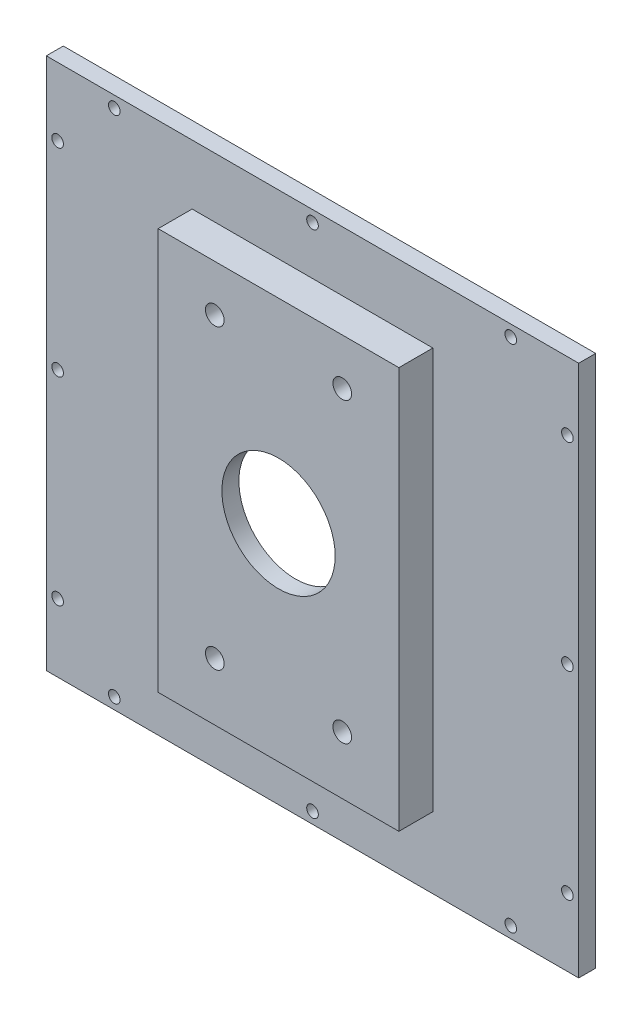
ISO-10303-21;
HEADER;
FILE_DESCRIPTION(('STEP AP214'),'2;1');
FILE_NAME('part.step','',(''),(''),'','','');
FILE_SCHEMA(('AUTOMOTIVE_DESIGN { 1 0 10303 214 1 1 1 1 }'));
ENDSEC;
DATA;
#1=APPLICATION_CONTEXT('core data for automotive mechanical design processes');
#2=APPLICATION_PROTOCOL_DEFINITION('international standard','automotive_design',2000,#1);
#3=PRODUCT_CONTEXT('',#1,'mechanical');
#4=PRODUCT('Part','Part','',(#3));
#5=PRODUCT_RELATED_PRODUCT_CATEGORY('part','',(#4));
#6=PRODUCT_DEFINITION_FORMATION('','',#4);
#7=PRODUCT_DEFINITION_CONTEXT('part definition',#1,'design');
#8=PRODUCT_DEFINITION('design','',#6,#7);
#9=PRODUCT_DEFINITION_SHAPE('','',#8);
#10=(LENGTH_UNIT() NAMED_UNIT(*) SI_UNIT(.MILLI.,.METRE.));
#11=(NAMED_UNIT(*) PLANE_ANGLE_UNIT() SI_UNIT($,.RADIAN.));
#12=(NAMED_UNIT(*) SI_UNIT($,.STERADIAN.) SOLID_ANGLE_UNIT());
#13=UNCERTAINTY_MEASURE_WITH_UNIT(LENGTH_MEASURE(1.E-05),#10,'distance_accuracy_value','');
#14=(GEOMETRIC_REPRESENTATION_CONTEXT(3) GLOBAL_UNCERTAINTY_ASSIGNED_CONTEXT((#13)) GLOBAL_UNIT_ASSIGNED_CONTEXT((#10,
#11,#12)) REPRESENTATION_CONTEXT('',''));
#15=CARTESIAN_POINT('',(0.,0.,0.));
#16=DIRECTION('',(0.,0.,1.));
#17=DIRECTION('',(1.,0.,0.));
#18=AXIS2_PLACEMENT_3D('',#15,#16,#17);
#19=CARTESIAN_POINT('',(-47.0000000000002,-1.66533453693774E-13,3.));
#20=DIRECTION('',(1.,0.,0.));
#21=DIRECTION('',(0.,1.,0.));
#22=AXIS2_PLACEMENT_3D('',#19,#20,#21);
#23=PLANE('',#22);
#24=DIRECTION('',(0.,-1.,0.));
#25=VECTOR('',#24,1.);
#26=CARTESIAN_POINT('',(-47.0000000000002,-1.66533453693774E-13,0.));
#27=LINE('',#26,#25);
#28=CARTESIAN_POINT('',(-47.0000000000003,44.9999999999998,0.));
#29=VERTEX_POINT('',#28);
#30=CARTESIAN_POINT('',(-47.,-49.0000000000002,0.));
#31=VERTEX_POINT('',#30);
#32=EDGE_CURVE('E125',#29,#31,#27,.T.);
#33=ORIENTED_EDGE('',*,*,#32,.T.);
#34=DIRECTION('',(0.,0.,-1.));
#35=VECTOR('',#34,1.);
#36=CARTESIAN_POINT('',(-47.,-49.0000000000002,3.));
#37=LINE('',#36,#35);
#38=CARTESIAN_POINT('',(-47.,-49.0000000000002,3.));
#39=VERTEX_POINT('',#38);
#40=EDGE_CURVE('E11',#39,#31,#37,.T.);
#41=ORIENTED_EDGE('',*,*,#40,.F.);
#42=DIRECTION('',(0.,-1.,0.));
#43=VECTOR('',#42,1.);
#44=CARTESIAN_POINT('',(-47.0000000000002,-1.66533453693774E-13,3.));
#45=LINE('',#44,#43);
#46=CARTESIAN_POINT('',(-47.0000000000003,44.9999999999998,3.));
#47=VERTEX_POINT('',#46);
#48=EDGE_CURVE('E133',#47,#39,#45,.T.);
#49=ORIENTED_EDGE('',*,*,#48,.F.);
#50=DIRECTION('',(0.,0.,-1.));
#51=VECTOR('',#50,1.);
#52=CARTESIAN_POINT('',(-47.0000000000003,44.9999999999998,3.));
#53=LINE('',#52,#51);
#54=EDGE_CURVE('E107',#47,#29,#53,.T.);
#55=ORIENTED_EDGE('',*,*,#54,.T.);
#56=EDGE_LOOP('',(#33,#41,#49,#55));
#57=FACE_BOUND('',#56,.T.);
#58=ADVANCED_FACE('F39',(#57),#23,.F.);
#59=CARTESIAN_POINT('',(-4.76008121807852E-12,-48.9999999999956,3.));
#60=DIRECTION('',(0.,1.,0.));
#61=DIRECTION('',(-1.,0.,0.));
#62=AXIS2_PLACEMENT_3D('',#59,#60,#61);
#63=PLANE('',#62);
#64=DIRECTION('',(1.,0.,0.));
#65=VECTOR('',#64,1.);
#66=CARTESIAN_POINT('',(-4.76008121807852E-12,-48.9999999999956,0.));
#67=LINE('',#66,#65);
#68=CARTESIAN_POINT('',(47.0000000000003,-49.0000000000002,0.));
#69=VERTEX_POINT('',#68);
#70=EDGE_CURVE('E128',#31,#69,#67,.T.);
#71=ORIENTED_EDGE('',*,*,#70,.T.);
#72=DIRECTION('',(0.,0.,-1.));
#73=VECTOR('',#72,1.);
#74=CARTESIAN_POINT('',(47.0000000000003,-49.0000000000002,3.));
#75=LINE('',#74,#73);
#76=CARTESIAN_POINT('',(47.0000000000003,-49.0000000000002,3.));
#77=VERTEX_POINT('',#76);
#78=EDGE_CURVE('E48',#77,#69,#75,.T.);
#79=ORIENTED_EDGE('',*,*,#78,.F.);
#80=DIRECTION('',(1.,0.,0.));
#81=VECTOR('',#80,1.);
#82=CARTESIAN_POINT('',(-4.76008121807852E-12,-48.9999999999956,3.));
#83=LINE('',#82,#81);
#84=EDGE_CURVE('E91',#39,#77,#83,.T.);
#85=ORIENTED_EDGE('',*,*,#84,.F.);
#86=ORIENTED_EDGE('',*,*,#40,.T.);
#87=EDGE_LOOP('',(#71,#79,#85,#86));
#88=FACE_BOUND('',#87,.T.);
#89=ADVANCED_FACE('F297',(#88),#63,.F.);
#90=CARTESIAN_POINT('',(47.0000000000002,1.66533453693774E-13,3.));
#91=DIRECTION('',(-1.,0.,0.));
#92=DIRECTION('',(0.,-1.,0.));
#93=AXIS2_PLACEMENT_3D('',#90,#91,#92);
#94=PLANE('',#93);
#95=DIRECTION('',(0.,1.,0.));
#96=VECTOR('',#95,1.);
#97=CARTESIAN_POINT('',(47.0000000000002,1.66533453693774E-13,0.));
#98=LINE('',#97,#96);
#99=CARTESIAN_POINT('',(47.,44.9999999999998,0.));
#100=VERTEX_POINT('',#99);
#101=EDGE_CURVE('E76',#69,#100,#98,.T.);
#102=ORIENTED_EDGE('',*,*,#101,.T.);
#103=DIRECTION('',(0.,0.,-1.));
#104=VECTOR('',#103,1.);
#105=CARTESIAN_POINT('',(47.,44.9999999999998,3.));
#106=LINE('',#105,#104);
#107=CARTESIAN_POINT('',(47.,44.9999999999998,3.));
#108=VERTEX_POINT('',#107);
#109=EDGE_CURVE('E105',#108,#100,#106,.T.);
#110=ORIENTED_EDGE('',*,*,#109,.F.);
#111=DIRECTION('',(0.,1.,0.));
#112=VECTOR('',#111,1.);
#113=CARTESIAN_POINT('',(47.0000000000002,1.66533453693774E-13,3.));
#114=LINE('',#113,#112);
#115=EDGE_CURVE('E99',#77,#108,#114,.T.);
#116=ORIENTED_EDGE('',*,*,#115,.F.);
#117=ORIENTED_EDGE('',*,*,#78,.T.);
#118=EDGE_LOOP('',(#102,#110,#116,#117));
#119=FACE_BOUND('',#118,.T.);
#120=ADVANCED_FACE('F106',(#119),#94,.F.);
#121=CARTESIAN_POINT('',(3.98119037736674E-12,45.000000000004,3.));
#122=DIRECTION('',(0.,-1.,0.));
#123=DIRECTION('',(1.,0.,0.));
#124=AXIS2_PLACEMENT_3D('',#121,#122,#123);
#125=PLANE('',#124);
#126=DIRECTION('',(-1.,0.,0.));
#127=VECTOR('',#126,1.);
#128=CARTESIAN_POINT('',(3.98119037736674E-12,45.000000000004,0.));
#129=LINE('',#128,#127);
#130=EDGE_CURVE('E83',#100,#29,#129,.T.);
#131=ORIENTED_EDGE('',*,*,#130,.T.);
#132=ORIENTED_EDGE('',*,*,#54,.F.);
#133=DIRECTION('',(-1.,0.,0.));
#134=VECTOR('',#133,1.);
#135=CARTESIAN_POINT('',(3.98119037736674E-12,45.000000000004,3.));
#136=LINE('',#135,#134);
#137=EDGE_CURVE('E103',#108,#47,#136,.T.);
#138=ORIENTED_EDGE('',*,*,#137,.F.);
#139=ORIENTED_EDGE('',*,*,#109,.T.);
#140=EDGE_LOOP('',(#131,#132,#138,#139));
#141=FACE_BOUND('',#140,.T.);
#142=ADVANCED_FACE('F109',(#141),#125,.F.);
#143=CARTESIAN_POINT('',(0.,0.,3.));
#144=DIRECTION('',(0.,0.,1.));
#145=DIRECTION('',(1.,0.,0.));
#146=AXIS2_PLACEMENT_3D('',#143,#144,#145);
#147=PLANE('',#146);
#148=CARTESIAN_POINT('',(44.9999999999998,-1.99999999999999,3.));
#149=DIRECTION('',(0.,0.,1.));
#150=DIRECTION('',(1.,0.,0.));
#151=AXIS2_PLACEMENT_3D('',#148,#149,#150);
#152=CIRCLE('',#151,1.02499999999999);
#153=CARTESIAN_POINT('',(46.0249999999998,-1.99999999999999,3.));
#154=VERTEX_POINT('',#153);
#155=EDGE_CURVE('E183',#154,#154,#152,.T.);
#156=ORIENTED_EDGE('',*,*,#155,.F.);
#157=EDGE_LOOP('',(#156));
#158=FACE_BOUND('',#157,.T.);
#159=CARTESIAN_POINT('',(45.0000000000001,-37.,3.));
#160=DIRECTION('',(0.,0.,1.));
#161=DIRECTION('',(1.,0.,0.));
#162=AXIS2_PLACEMENT_3D('',#159,#160,#161);
#163=CIRCLE('',#162,1.02499999999999);
#164=CARTESIAN_POINT('',(46.0250000000001,-37.,3.));
#165=VERTEX_POINT('',#164);
#166=EDGE_CURVE('E172',#165,#165,#163,.T.);
#167=ORIENTED_EDGE('',*,*,#166,.F.);
#168=EDGE_LOOP('',(#167));
#169=FACE_BOUND('',#168,.T.);
#170=CARTESIAN_POINT('',(34.9999999999992,-46.9999999999994,3.));
#171=DIRECTION('',(0.,0.,1.));
#172=DIRECTION('',(1.,0.,0.));
#173=AXIS2_PLACEMENT_3D('',#170,#171,#172);
#174=CIRCLE('',#173,1.02499999999999);
#175=CARTESIAN_POINT('',(36.0249999999991,-46.9999999999994,3.));
#176=VERTEX_POINT('',#175);
#177=EDGE_CURVE('E171',#176,#176,#174,.T.);
#178=ORIENTED_EDGE('',*,*,#177,.F.);
#179=EDGE_LOOP('',(#178));
#180=FACE_BOUND('',#179,.T.);
#181=CARTESIAN_POINT('',(-8.46545056276682E-13,-46.9999999999999,3.));
#182=DIRECTION('',(0.,0.,1.));
#183=DIRECTION('',(1.,0.,0.));
#184=AXIS2_PLACEMENT_3D('',#181,#182,#183);
#185=CIRCLE('',#184,1.02499999999999);
#186=CARTESIAN_POINT('',(1.02499999999914,-46.9999999999999,3.));
#187=VERTEX_POINT('',#186);
#188=EDGE_CURVE('E188',#187,#187,#185,.T.);
#189=ORIENTED_EDGE('',*,*,#188,.F.);
#190=EDGE_LOOP('',(#189));
#191=FACE_BOUND('',#190,.T.);
#192=CARTESIAN_POINT('',(-35.0000000000009,-47.0000000000001,3.));
#193=DIRECTION('',(0.,0.,1.));
#194=DIRECTION('',(1.,0.,0.));
#195=AXIS2_PLACEMENT_3D('',#192,#193,#194);
#196=CIRCLE('',#195,1.02499999999999);
#197=CARTESIAN_POINT('',(-33.9750000000009,-47.0000000000001,3.));
#198=VERTEX_POINT('',#197);
#199=EDGE_CURVE('E168',#198,#198,#196,.T.);
#200=ORIENTED_EDGE('',*,*,#199,.F.);
#201=EDGE_LOOP('',(#200));
#202=FACE_BOUND('',#201,.T.);
#203=CARTESIAN_POINT('',(-45.0000000000003,32.9999999999999,3.));
#204=DIRECTION('',(0.,0.,1.));
#205=DIRECTION('',(1.,0.,0.));
#206=AXIS2_PLACEMENT_3D('',#203,#204,#205);
#207=CIRCLE('',#206,1.02499999999999);
#208=CARTESIAN_POINT('',(-43.9750000000003,32.9999999999999,3.));
#209=VERTEX_POINT('',#208);
#210=EDGE_CURVE('E165',#209,#209,#207,.T.);
#211=ORIENTED_EDGE('',*,*,#210,.F.);
#212=EDGE_LOOP('',(#211));
#213=FACE_BOUND('',#212,.T.);
#214=CARTESIAN_POINT('',(-45.0000000000002,-2.00000000000009,3.));
#215=DIRECTION('',(0.,0.,1.));
#216=DIRECTION('',(1.,0.,0.));
#217=AXIS2_PLACEMENT_3D('',#214,#215,#216);
#218=CIRCLE('',#217,1.02499999999999);
#219=CARTESIAN_POINT('',(-43.9750000000002,-2.00000000000009,3.));
#220=VERTEX_POINT('',#219);
#221=EDGE_CURVE('E161',#220,#220,#218,.T.);
#222=ORIENTED_EDGE('',*,*,#221,.F.);
#223=EDGE_LOOP('',(#222));
#224=FACE_BOUND('',#223,.T.);
#225=CARTESIAN_POINT('',(-44.9999999999998,-37.0000000000001,3.));
#226=DIRECTION('',(0.,0.,1.));
#227=DIRECTION('',(1.,0.,0.));
#228=AXIS2_PLACEMENT_3D('',#225,#226,#227);
#229=CIRCLE('',#228,1.02499999999999);
#230=CARTESIAN_POINT('',(-43.9749999999998,-37.0000000000001,3.));
#231=VERTEX_POINT('',#230);
#232=EDGE_CURVE('E157',#231,#231,#229,.T.);
#233=ORIENTED_EDGE('',*,*,#232,.F.);
#234=EDGE_LOOP('',(#233));
#235=FACE_BOUND('',#234,.T.);
#236=CARTESIAN_POINT('',(-34.9999999999981,42.9999999999971,3.));
#237=DIRECTION('',(0.,0.,1.));
#238=DIRECTION('',(1.,0.,0.));
#239=AXIS2_PLACEMENT_3D('',#236,#237,#238);
#240=CIRCLE('',#239,1.02499999999999);
#241=CARTESIAN_POINT('',(-33.9749999999982,42.9999999999971,3.));
#242=VERTEX_POINT('',#241);
#243=EDGE_CURVE('E153',#242,#242,#240,.T.);
#244=ORIENTED_EDGE('',*,*,#243,.F.);
#245=EDGE_LOOP('',(#244));
#246=FACE_BOUND('',#245,.T.);
#247=CARTESIAN_POINT('',(1.86309301319909E-12,42.9999999999974,3.));
#248=DIRECTION('',(0.,0.,1.));
#249=DIRECTION('',(1.,0.,0.));
#250=AXIS2_PLACEMENT_3D('',#247,#248,#249);
#251=CIRCLE('',#250,1.02499999999999);
#252=CARTESIAN_POINT('',(1.02500000000185,42.9999999999974,3.));
#253=VERTEX_POINT('',#252);
#254=EDGE_CURVE('E149',#253,#253,#251,.T.);
#255=ORIENTED_EDGE('',*,*,#254,.F.);
#256=EDGE_LOOP('',(#255));
#257=FACE_BOUND('',#256,.T.);
#258=CARTESIAN_POINT('',(35.0000000000019,42.9999999999978,3.));
#259=DIRECTION('',(0.,0.,1.));
#260=DIRECTION('',(1.,0.,0.));
#261=AXIS2_PLACEMENT_3D('',#258,#259,#260);
#262=CIRCLE('',#261,1.02499999999999);
#263=CARTESIAN_POINT('',(36.0250000000019,42.9999999999978,3.));
#264=VERTEX_POINT('',#263);
#265=EDGE_CURVE('E145',#264,#264,#262,.T.);
#266=ORIENTED_EDGE('',*,*,#265,.F.);
#267=EDGE_LOOP('',(#266));
#268=FACE_BOUND('',#267,.T.);
#269=CARTESIAN_POINT('',(44.9999999999997,33.,3.));
#270=DIRECTION('',(0.,0.,1.));
#271=DIRECTION('',(1.,0.,0.));
#272=AXIS2_PLACEMENT_3D('',#269,#270,#271);
#273=CIRCLE('',#272,1.02499999999999);
#274=CARTESIAN_POINT('',(46.0249999999997,33.,3.));
#275=VERTEX_POINT('',#274);
#276=EDGE_CURVE('E144',#275,#275,#273,.T.);
#277=ORIENTED_EDGE('',*,*,#276,.F.);
#278=EDGE_LOOP('',(#277));
#279=FACE_BOUND('',#278,.T.);
#280=ORIENTED_EDGE('',*,*,#48,.T.);
#281=ORIENTED_EDGE('',*,*,#84,.T.);
#282=ORIENTED_EDGE('',*,*,#115,.T.);
#283=ORIENTED_EDGE('',*,*,#137,.T.);
#284=EDGE_LOOP('',(#280,#281,#282,#283));
#285=FACE_BOUND('',#284,.T.);
#286=DIRECTION('',(-1.,0.,0.));
#287=VECTOR('',#286,1.);
#288=CARTESIAN_POINT('',(0.,34.4499999999995,3.));
#289=LINE('',#288,#287);
#290=CARTESIAN_POINT('',(21.2500000000037,34.4499999999995,3.));
#291=VERTEX_POINT('',#290);
#292=CARTESIAN_POINT('',(-21.25,34.4499999999995,3.));
#293=VERTEX_POINT('',#292);
#294=EDGE_CURVE('E111',#291,#293,#289,.T.);
#295=ORIENTED_EDGE('',*,*,#294,.F.);
#296=DIRECTION('',(0.,1.,0.));
#297=VECTOR('',#296,1.);
#298=CARTESIAN_POINT('',(21.2500000000037,0.,3.));
#299=LINE('',#298,#297);
#300=CARTESIAN_POINT('',(21.2500000000037,-36.4499999999999,3.));
#301=VERTEX_POINT('',#300);
#302=EDGE_CURVE('E113',#301,#291,#299,.T.);
#303=ORIENTED_EDGE('',*,*,#302,.F.);
#304=DIRECTION('',(1.,0.,0.));
#305=VECTOR('',#304,1.);
#306=CARTESIAN_POINT('',(0.,-36.4499999999999,3.));
#307=LINE('',#306,#305);
#308=CARTESIAN_POINT('',(-21.25,-36.4499999999999,3.));
#309=VERTEX_POINT('',#308);
#310=EDGE_CURVE('E119',#309,#301,#307,.T.);
#311=ORIENTED_EDGE('',*,*,#310,.F.);
#312=DIRECTION('',(0.,1.,0.));
#313=VECTOR('',#312,1.);
#314=CARTESIAN_POINT('',(-21.25,0.,3.));
#315=LINE('',#314,#313);
#316=EDGE_CURVE('E122',#309,#293,#315,.T.);
#317=ORIENTED_EDGE('',*,*,#316,.T.);
#318=EDGE_LOOP('',(#295,#303,#311,#317));
#319=FACE_BOUND('',#318,.T.);
#320=ADVANCED_FACE('F100',(#158,#169,#180,#191,#202,#213,#224,#235,#246,#257,#268,#279,#285,
#319),#147,.T.);
#321=CARTESIAN_POINT('',(0.,0.,0.));
#322=DIRECTION('',(0.,0.,1.));
#323=DIRECTION('',(1.,0.,0.));
#324=AXIS2_PLACEMENT_3D('',#321,#322,#323);
#325=PLANE('',#324);
#326=CARTESIAN_POINT('',(44.9999999999998,-1.99999999999999,0.));
#327=DIRECTION('',(0.,0.,1.));
#328=DIRECTION('',(1.,0.,0.));
#329=AXIS2_PLACEMENT_3D('',#326,#327,#328);
#330=CIRCLE('',#329,1.02499999999999);
#331=CARTESIAN_POINT('',(46.0249999999998,-1.99999999999999,0.));
#332=VERTEX_POINT('',#331);
#333=EDGE_CURVE('E42',#332,#332,#330,.T.);
#334=ORIENTED_EDGE('',*,*,#333,.T.);
#335=EDGE_LOOP('',(#334));
#336=FACE_BOUND('',#335,.T.);
#337=CARTESIAN_POINT('',(45.0000000000001,-37.,0.));
#338=DIRECTION('',(0.,0.,1.));
#339=DIRECTION('',(1.,0.,0.));
#340=AXIS2_PLACEMENT_3D('',#337,#338,#339);
#341=CIRCLE('',#340,1.02499999999999);
#342=CARTESIAN_POINT('',(46.0250000000001,-37.,0.));
#343=VERTEX_POINT('',#342);
#344=EDGE_CURVE('E169',#343,#343,#341,.T.);
#345=ORIENTED_EDGE('',*,*,#344,.T.);
#346=EDGE_LOOP('',(#345));
#347=FACE_BOUND('',#346,.T.);
#348=CARTESIAN_POINT('',(34.9999999999992,-46.9999999999994,0.));
#349=DIRECTION('',(0.,0.,1.));
#350=DIRECTION('',(1.,0.,0.));
#351=AXIS2_PLACEMENT_3D('',#348,#349,#350);
#352=CIRCLE('',#351,1.02499999999999);
#353=CARTESIAN_POINT('',(36.0249999999991,-46.9999999999994,0.));
#354=VERTEX_POINT('',#353);
#355=EDGE_CURVE('E176',#354,#354,#352,.T.);
#356=ORIENTED_EDGE('',*,*,#355,.T.);
#357=EDGE_LOOP('',(#356));
#358=FACE_BOUND('',#357,.T.);
#359=CARTESIAN_POINT('',(-8.46545056276682E-13,-46.9999999999999,0.));
#360=DIRECTION('',(0.,0.,1.));
#361=DIRECTION('',(1.,0.,0.));
#362=AXIS2_PLACEMENT_3D('',#359,#360,#361);
#363=CIRCLE('',#362,1.02499999999999);
#364=CARTESIAN_POINT('',(1.02499999999914,-46.9999999999999,0.));
#365=VERTEX_POINT('',#364);
#366=EDGE_CURVE('E191',#365,#365,#363,.T.);
#367=ORIENTED_EDGE('',*,*,#366,.T.);
#368=EDGE_LOOP('',(#367));
#369=FACE_BOUND('',#368,.T.);
#370=CARTESIAN_POINT('',(-35.0000000000009,-47.0000000000001,0.));
#371=DIRECTION('',(0.,0.,1.));
#372=DIRECTION('',(1.,0.,0.));
#373=AXIS2_PLACEMENT_3D('',#370,#371,#372);
#374=CIRCLE('',#373,1.02499999999999);
#375=CARTESIAN_POINT('',(-33.9750000000009,-47.0000000000001,0.));
#376=VERTEX_POINT('',#375);
#377=EDGE_CURVE('E166',#376,#376,#374,.T.);
#378=ORIENTED_EDGE('',*,*,#377,.T.);
#379=EDGE_LOOP('',(#378));
#380=FACE_BOUND('',#379,.T.);
#381=CARTESIAN_POINT('',(-45.0000000000003,32.9999999999999,0.));
#382=DIRECTION('',(0.,0.,1.));
#383=DIRECTION('',(1.,0.,0.));
#384=AXIS2_PLACEMENT_3D('',#381,#382,#383);
#385=CIRCLE('',#384,1.02499999999999);
#386=CARTESIAN_POINT('',(-43.9750000000003,32.9999999999999,0.));
#387=VERTEX_POINT('',#386);
#388=EDGE_CURVE('E162',#387,#387,#385,.T.);
#389=ORIENTED_EDGE('',*,*,#388,.T.);
#390=EDGE_LOOP('',(#389));
#391=FACE_BOUND('',#390,.T.);
#392=CARTESIAN_POINT('',(-45.0000000000002,-2.00000000000009,0.));
#393=DIRECTION('',(0.,0.,1.));
#394=DIRECTION('',(1.,0.,0.));
#395=AXIS2_PLACEMENT_3D('',#392,#393,#394);
#396=CIRCLE('',#395,1.02499999999999);
#397=CARTESIAN_POINT('',(-43.9750000000002,-2.00000000000009,0.));
#398=VERTEX_POINT('',#397);
#399=EDGE_CURVE('E158',#398,#398,#396,.T.);
#400=ORIENTED_EDGE('',*,*,#399,.T.);
#401=EDGE_LOOP('',(#400));
#402=FACE_BOUND('',#401,.T.);
#403=CARTESIAN_POINT('',(-44.9999999999998,-37.0000000000001,0.));
#404=DIRECTION('',(0.,0.,1.));
#405=DIRECTION('',(1.,0.,0.));
#406=AXIS2_PLACEMENT_3D('',#403,#404,#405);
#407=CIRCLE('',#406,1.02499999999999);
#408=CARTESIAN_POINT('',(-43.9749999999998,-37.0000000000001,0.));
#409=VERTEX_POINT('',#408);
#410=EDGE_CURVE('E154',#409,#409,#407,.T.);
#411=ORIENTED_EDGE('',*,*,#410,.T.);
#412=EDGE_LOOP('',(#411));
#413=FACE_BOUND('',#412,.T.);
#414=CARTESIAN_POINT('',(-34.9999999999981,42.9999999999971,0.));
#415=DIRECTION('',(0.,0.,1.));
#416=DIRECTION('',(1.,0.,0.));
#417=AXIS2_PLACEMENT_3D('',#414,#415,#416);
#418=CIRCLE('',#417,1.02499999999999);
#419=CARTESIAN_POINT('',(-33.9749999999982,42.9999999999971,0.));
#420=VERTEX_POINT('',#419);
#421=EDGE_CURVE('E150',#420,#420,#418,.T.);
#422=ORIENTED_EDGE('',*,*,#421,.T.);
#423=EDGE_LOOP('',(#422));
#424=FACE_BOUND('',#423,.T.);
#425=CARTESIAN_POINT('',(1.86309301319909E-12,42.9999999999974,0.));
#426=DIRECTION('',(0.,0.,1.));
#427=DIRECTION('',(1.,0.,0.));
#428=AXIS2_PLACEMENT_3D('',#425,#426,#427);
#429=CIRCLE('',#428,1.02499999999999);
#430=CARTESIAN_POINT('',(1.02500000000185,42.9999999999974,0.));
#431=VERTEX_POINT('',#430);
#432=EDGE_CURVE('E146',#431,#431,#429,.T.);
#433=ORIENTED_EDGE('',*,*,#432,.T.);
#434=EDGE_LOOP('',(#433));
#435=FACE_BOUND('',#434,.T.);
#436=CARTESIAN_POINT('',(35.0000000000019,42.9999999999978,0.));
#437=DIRECTION('',(0.,0.,1.));
#438=DIRECTION('',(1.,0.,0.));
#439=AXIS2_PLACEMENT_3D('',#436,#437,#438);
#440=CIRCLE('',#439,1.02499999999999);
#441=CARTESIAN_POINT('',(36.0250000000018,42.9999999999978,0.));
#442=VERTEX_POINT('',#441);
#443=EDGE_CURVE('E141',#442,#442,#440,.T.);
#444=ORIENTED_EDGE('',*,*,#443,.T.);
#445=EDGE_LOOP('',(#444));
#446=FACE_BOUND('',#445,.T.);
#447=CARTESIAN_POINT('',(44.9999999999997,33.,0.));
#448=DIRECTION('',(0.,0.,1.));
#449=DIRECTION('',(1.,0.,0.));
#450=AXIS2_PLACEMENT_3D('',#447,#448,#449);
#451=CIRCLE('',#450,1.02499999999999);
#452=CARTESIAN_POINT('',(46.0249999999997,33.,0.));
#453=VERTEX_POINT('',#452);
#454=EDGE_CURVE('E210',#453,#453,#451,.T.);
#455=ORIENTED_EDGE('',*,*,#454,.T.);
#456=EDGE_LOOP('',(#455));
#457=FACE_BOUND('',#456,.T.);
#458=ORIENTED_EDGE('',*,*,#32,.F.);
#459=ORIENTED_EDGE('',*,*,#130,.F.);
#460=ORIENTED_EDGE('',*,*,#101,.F.);
#461=ORIENTED_EDGE('',*,*,#70,.F.);
#462=EDGE_LOOP('',(#458,#459,#460,#461));
#463=FACE_BOUND('',#462,.T.);
#464=DIRECTION('',(1.,0.,0.));
#465=VECTOR('',#464,1.);
#466=CARTESIAN_POINT('',(0.,30.4499999999995,0.));
#467=LINE('',#466,#465);
#468=CARTESIAN_POINT('',(-16.25,30.4499999999995,0.));
#469=VERTEX_POINT('',#468);
#470=CARTESIAN_POINT('',(16.2500000000037,30.4499999999995,0.));
#471=VERTEX_POINT('',#470);
#472=EDGE_CURVE('E247',#469,#471,#467,.T.);
#473=ORIENTED_EDGE('',*,*,#472,.F.);
#474=DIRECTION('',(0.,1.,0.));
#475=VECTOR('',#474,1.);
#476=CARTESIAN_POINT('',(-16.25,0.,0.));
#477=LINE('',#476,#475);
#478=CARTESIAN_POINT('',(-16.25,-30.4499999999995,0.));
#479=VERTEX_POINT('',#478);
#480=EDGE_CURVE('E254',#479,#469,#477,.T.);
#481=ORIENTED_EDGE('',*,*,#480,.F.);
#482=DIRECTION('',(1.,0.,0.));
#483=VECTOR('',#482,1.);
#484=CARTESIAN_POINT('',(0.,-30.4499999999995,0.));
#485=LINE('',#484,#483);
#486=CARTESIAN_POINT('',(16.2500000000037,-30.4499999999995,0.));
#487=VERTEX_POINT('',#486);
#488=EDGE_CURVE('E269',#479,#487,#485,.T.);
#489=ORIENTED_EDGE('',*,*,#488,.T.);
#490=DIRECTION('',(0.,-1.,0.));
#491=VECTOR('',#490,1.);
#492=CARTESIAN_POINT('',(16.2500000000037,0.,0.));
#493=LINE('',#492,#491);
#494=EDGE_CURVE('E266',#471,#487,#493,.T.);
#495=ORIENTED_EDGE('',*,*,#494,.F.);
#496=EDGE_LOOP('',(#473,#481,#489,#495));
#497=FACE_BOUND('',#496,.T.);
#498=ADVANCED_FACE('F299',(#336,#347,#358,#369,#380,#391,#402,#413,#424,#435,#446,#457,#463,
#497),#325,.F.);
#499=CARTESIAN_POINT('',(0.,-36.4499999999999,6.));
#500=DIRECTION('',(0.,-1.,0.));
#501=DIRECTION('',(0.,0.,-1.));
#502=AXIS2_PLACEMENT_3D('',#499,#500,#501);
#503=PLANE('',#502);
#504=DIRECTION('',(0.,0.,-1.));
#505=VECTOR('',#504,1.);
#506=CARTESIAN_POINT('',(-21.25,-36.4499999999999,6.));
#507=LINE('',#506,#505);
#508=CARTESIAN_POINT('',(-21.25,-36.4499999999999,9.));
#509=VERTEX_POINT('',#508);
#510=EDGE_CURVE('E274',#509,#309,#507,.T.);
#511=ORIENTED_EDGE('',*,*,#510,.T.);
#512=ORIENTED_EDGE('',*,*,#310,.T.);
#513=DIRECTION('',(0.,0.,-1.));
#514=VECTOR('',#513,1.);
#515=CARTESIAN_POINT('',(21.2500000000037,-36.4499999999999,6.));
#516=LINE('',#515,#514);
#517=CARTESIAN_POINT('',(21.2500000000037,-36.4499999999999,9.));
#518=VERTEX_POINT('',#517);
#519=EDGE_CURVE('E129',#518,#301,#516,.T.);
#520=ORIENTED_EDGE('',*,*,#519,.F.);
#521=DIRECTION('',(-1.,0.,0.));
#522=VECTOR('',#521,1.);
#523=CARTESIAN_POINT('',(0.,-36.4499999999999,9.));
#524=LINE('',#523,#522);
#525=EDGE_CURVE('E244',#518,#509,#524,.T.);
#526=ORIENTED_EDGE('',*,*,#525,.T.);
#527=EDGE_LOOP('',(#511,#512,#520,#526));
#528=FACE_BOUND('',#527,.T.);
#529=ADVANCED_FACE('F302',(#528),#503,.T.);
#530=CARTESIAN_POINT('',(21.2500000000037,0.,6.));
#531=DIRECTION('',(-1.,0.,0.));
#532=DIRECTION('',(0.,0.,1.));
#533=AXIS2_PLACEMENT_3D('',#530,#531,#532);
#534=PLANE('',#533);
#535=ORIENTED_EDGE('',*,*,#302,.T.);
#536=DIRECTION('',(0.,0.,-1.));
#537=VECTOR('',#536,1.);
#538=CARTESIAN_POINT('',(21.2500000000037,34.4499999999995,6.));
#539=LINE('',#538,#537);
#540=CARTESIAN_POINT('',(21.2500000000037,34.4499999999995,9.));
#541=VERTEX_POINT('',#540);
#542=EDGE_CURVE('E279',#541,#291,#539,.T.);
#543=ORIENTED_EDGE('',*,*,#542,.F.);
#544=DIRECTION('',(0.,1.,0.));
#545=VECTOR('',#544,1.);
#546=CARTESIAN_POINT('',(21.2500000000037,0.,9.));
#547=LINE('',#546,#545);
#548=EDGE_CURVE('E236',#518,#541,#547,.T.);
#549=ORIENTED_EDGE('',*,*,#548,.F.);
#550=ORIENTED_EDGE('',*,*,#519,.T.);
#551=EDGE_LOOP('',(#535,#543,#549,#550));
#552=FACE_BOUND('',#551,.T.);
#553=ADVANCED_FACE('F340',(#552),#534,.F.);
#554=CARTESIAN_POINT('',(0.,34.4499999999995,6.));
#555=DIRECTION('',(0.,-1.,0.));
#556=DIRECTION('',(0.,0.,-1.));
#557=AXIS2_PLACEMENT_3D('',#554,#555,#556);
#558=PLANE('',#557);
#559=ORIENTED_EDGE('',*,*,#294,.T.);
#560=DIRECTION('',(0.,0.,-1.));
#561=VECTOR('',#560,1.);
#562=CARTESIAN_POINT('',(-21.25,34.4499999999995,6.));
#563=LINE('',#562,#561);
#564=CARTESIAN_POINT('',(-21.25,34.4499999999995,9.));
#565=VERTEX_POINT('',#564);
#566=EDGE_CURVE('E57',#565,#293,#563,.T.);
#567=ORIENTED_EDGE('',*,*,#566,.F.);
#568=DIRECTION('',(-1.,0.,0.));
#569=VECTOR('',#568,1.);
#570=CARTESIAN_POINT('',(0.,34.4499999999995,9.));
#571=LINE('',#570,#569);
#572=EDGE_CURVE('E239',#541,#565,#571,.T.);
#573=ORIENTED_EDGE('',*,*,#572,.F.);
#574=ORIENTED_EDGE('',*,*,#542,.T.);
#575=EDGE_LOOP('',(#559,#567,#573,#574));
#576=FACE_BOUND('',#575,.T.);
#577=ADVANCED_FACE('F344',(#576),#558,.F.);
#578=CARTESIAN_POINT('',(0.,30.4499999999995,6.));
#579=DIRECTION('',(0.,1.,0.));
#580=DIRECTION('',(0.,0.,1.));
#581=AXIS2_PLACEMENT_3D('',#578,#579,#580);
#582=PLANE('',#581);
#583=ORIENTED_EDGE('',*,*,#472,.T.);
#584=DIRECTION('',(0.,0.,-1.));
#585=VECTOR('',#584,1.);
#586=CARTESIAN_POINT('',(16.2500000000037,30.4499999999995,6.));
#587=LINE('',#586,#585);
#588=CARTESIAN_POINT('',(16.2500000000037,30.4499999999995,6.));
#589=VERTEX_POINT('',#588);
#590=EDGE_CURVE('E277',#589,#471,#587,.T.);
#591=ORIENTED_EDGE('',*,*,#590,.F.);
#592=DIRECTION('',(1.,0.,0.));
#593=VECTOR('',#592,1.);
#594=CARTESIAN_POINT('',(0.,30.4499999999995,6.));
#595=LINE('',#594,#593);
#596=CARTESIAN_POINT('',(-16.25,30.4499999999995,6.));
#597=VERTEX_POINT('',#596);
#598=EDGE_CURVE('E250',#597,#589,#595,.T.);
#599=ORIENTED_EDGE('',*,*,#598,.F.);
#600=DIRECTION('',(0.,0.,-1.));
#601=VECTOR('',#600,1.);
#602=CARTESIAN_POINT('',(-16.25,30.4499999999995,6.));
#603=LINE('',#602,#601);
#604=EDGE_CURVE('E263',#597,#469,#603,.T.);
#605=ORIENTED_EDGE('',*,*,#604,.T.);
#606=EDGE_LOOP('',(#583,#591,#599,#605));
#607=FACE_BOUND('',#606,.T.);
#608=ADVANCED_FACE('F316',(#607),#582,.F.);
#609=CARTESIAN_POINT('',(16.2500000000037,0.,6.));
#610=DIRECTION('',(1.,0.,0.));
#611=DIRECTION('',(0.,0.,-1.));
#612=AXIS2_PLACEMENT_3D('',#609,#610,#611);
#613=PLANE('',#612);
#614=ORIENTED_EDGE('',*,*,#494,.T.);
#615=DIRECTION('',(0.,0.,-1.));
#616=VECTOR('',#615,1.);
#617=CARTESIAN_POINT('',(16.2500000000037,-30.4499999999995,6.));
#618=LINE('',#617,#616);
#619=CARTESIAN_POINT('',(16.2500000000037,-30.4499999999995,6.));
#620=VERTEX_POINT('',#619);
#621=EDGE_CURVE('E289',#620,#487,#618,.T.);
#622=ORIENTED_EDGE('',*,*,#621,.F.);
#623=DIRECTION('',(0.,-1.,0.));
#624=VECTOR('',#623,1.);
#625=CARTESIAN_POINT('',(16.2500000000037,0.,6.));
#626=LINE('',#625,#624);
#627=EDGE_CURVE('E253',#589,#620,#626,.T.);
#628=ORIENTED_EDGE('',*,*,#627,.F.);
#629=ORIENTED_EDGE('',*,*,#590,.T.);
#630=EDGE_LOOP('',(#614,#622,#628,#629));
#631=FACE_BOUND('',#630,.T.);
#632=ADVANCED_FACE('F367',(#631),#613,.F.);
#633=CARTESIAN_POINT('',(0.,-30.4499999999995,6.));
#634=DIRECTION('',(0.,1.,0.));
#635=DIRECTION('',(0.,0.,1.));
#636=AXIS2_PLACEMENT_3D('',#633,#634,#635);
#637=PLANE('',#636);
#638=ORIENTED_EDGE('',*,*,#488,.F.);
#639=DIRECTION('',(0.,0.,-1.));
#640=VECTOR('',#639,1.);
#641=CARTESIAN_POINT('',(-16.25,-30.4499999999995,6.));
#642=LINE('',#641,#640);
#643=CARTESIAN_POINT('',(-16.25,-30.4499999999995,6.));
#644=VERTEX_POINT('',#643);
#645=EDGE_CURVE('E286',#644,#479,#642,.T.);
#646=ORIENTED_EDGE('',*,*,#645,.F.);
#647=DIRECTION('',(1.,0.,0.));
#648=VECTOR('',#647,1.);
#649=CARTESIAN_POINT('',(0.,-30.4499999999995,6.));
#650=LINE('',#649,#648);
#651=EDGE_CURVE('E257',#644,#620,#650,.T.);
#652=ORIENTED_EDGE('',*,*,#651,.T.);
#653=ORIENTED_EDGE('',*,*,#621,.T.);
#654=EDGE_LOOP('',(#638,#646,#652,#653));
#655=FACE_BOUND('',#654,.T.);
#656=ADVANCED_FACE('F361',(#655),#637,.T.);
#657=CARTESIAN_POINT('',(-16.25,0.,6.));
#658=DIRECTION('',(-1.,0.,0.));
#659=DIRECTION('',(0.,0.,1.));
#660=AXIS2_PLACEMENT_3D('',#657,#658,#659);
#661=PLANE('',#660);
#662=ORIENTED_EDGE('',*,*,#480,.T.);
#663=ORIENTED_EDGE('',*,*,#604,.F.);
#664=DIRECTION('',(0.,1.,0.));
#665=VECTOR('',#664,1.);
#666=CARTESIAN_POINT('',(-16.25,0.,6.));
#667=LINE('',#666,#665);
#668=EDGE_CURVE('E260',#644,#597,#667,.T.);
#669=ORIENTED_EDGE('',*,*,#668,.F.);
#670=ORIENTED_EDGE('',*,*,#645,.T.);
#671=EDGE_LOOP('',(#662,#663,#669,#670));
#672=FACE_BOUND('',#671,.T.);
#673=ADVANCED_FACE('F364',(#672),#661,.F.);
#674=CARTESIAN_POINT('',(-21.25,0.,6.));
#675=DIRECTION('',(-1.,0.,0.));
#676=DIRECTION('',(0.,0.,1.));
#677=AXIS2_PLACEMENT_3D('',#674,#675,#676);
#678=PLANE('',#677);
#679=ORIENTED_EDGE('',*,*,#566,.T.);
#680=ORIENTED_EDGE('',*,*,#316,.F.);
#681=ORIENTED_EDGE('',*,*,#510,.F.);
#682=DIRECTION('',(0.,1.,0.));
#683=VECTOR('',#682,1.);
#684=CARTESIAN_POINT('',(-21.25,0.,9.));
#685=LINE('',#684,#683);
#686=EDGE_CURVE('E242',#509,#565,#685,.T.);
#687=ORIENTED_EDGE('',*,*,#686,.T.);
#688=EDGE_LOOP('',(#679,#680,#681,#687));
#689=FACE_BOUND('',#688,.T.);
#690=ADVANCED_FACE('F453',(#689),#678,.T.);
#691=CARTESIAN_POINT('',(0.,0.,6.));
#692=DIRECTION('',(0.,0.,1.));
#693=DIRECTION('',(1.,0.,0.));
#694=AXIS2_PLACEMENT_3D('',#691,#692,#693);
#695=PLANE('',#694);
#696=CARTESIAN_POINT('',(11.25,26.25,6.));
#697=DIRECTION('',(0.,0.,1.));
#698=DIRECTION('',(1.,0.,0.));
#699=AXIS2_PLACEMENT_3D('',#696,#697,#698);
#700=CIRCLE('',#699,1.64999999999999);
#701=CARTESIAN_POINT('',(12.9,26.25,6.));
#702=VERTEX_POINT('',#701);
#703=EDGE_CURVE('E136',#702,#702,#700,.T.);
#704=ORIENTED_EDGE('',*,*,#703,.T.);
#705=EDGE_LOOP('',(#704));
#706=FACE_BOUND('',#705,.T.);
#707=CARTESIAN_POINT('',(-11.2499999999963,26.25,6.));
#708=DIRECTION('',(0.,0.,1.));
#709=DIRECTION('',(1.,0.,0.));
#710=AXIS2_PLACEMENT_3D('',#707,#708,#709);
#711=CIRCLE('',#710,1.64999999999999);
#712=CARTESIAN_POINT('',(-9.59999999999628,26.25,6.));
#713=VERTEX_POINT('',#712);
#714=EDGE_CURVE('E217',#713,#713,#711,.T.);
#715=ORIENTED_EDGE('',*,*,#714,.T.);
#716=EDGE_LOOP('',(#715));
#717=FACE_BOUND('',#716,.T.);
#718=CARTESIAN_POINT('',(-11.2499999999963,-26.25,6.));
#719=DIRECTION('',(0.,0.,1.));
#720=DIRECTION('',(1.,0.,0.));
#721=AXIS2_PLACEMENT_3D('',#718,#719,#720);
#722=CIRCLE('',#721,1.64999999999999);
#723=CARTESIAN_POINT('',(-9.59999999999628,-26.25,6.));
#724=VERTEX_POINT('',#723);
#725=EDGE_CURVE('E223',#724,#724,#722,.T.);
#726=ORIENTED_EDGE('',*,*,#725,.T.);
#727=EDGE_LOOP('',(#726));
#728=FACE_BOUND('',#727,.T.);
#729=CARTESIAN_POINT('',(11.25,-26.25,6.));
#730=DIRECTION('',(0.,0.,1.));
#731=DIRECTION('',(1.,0.,0.));
#732=AXIS2_PLACEMENT_3D('',#729,#730,#731);
#733=CIRCLE('',#732,1.64999999999999);
#734=CARTESIAN_POINT('',(12.9,-26.25,6.));
#735=VERTEX_POINT('',#734);
#736=EDGE_CURVE('E229',#735,#735,#733,.T.);
#737=ORIENTED_EDGE('',*,*,#736,.T.);
#738=EDGE_LOOP('',(#737));
#739=FACE_BOUND('',#738,.T.);
#740=CARTESIAN_POINT('',(0.,0.,6.));
#741=DIRECTION('',(0.,0.,1.));
#742=DIRECTION('',(1.,0.,0.));
#743=AXIS2_PLACEMENT_3D('',#740,#741,#742);
#744=CIRCLE('',#743,10.);
#745=CARTESIAN_POINT('',(10.,0.,6.));
#746=VERTEX_POINT('',#745);
#747=EDGE_CURVE('E232',#746,#746,#744,.T.);
#748=ORIENTED_EDGE('',*,*,#747,.T.);
#749=EDGE_LOOP('',(#748));
#750=FACE_BOUND('',#749,.T.);
#751=ORIENTED_EDGE('',*,*,#668,.T.);
#752=ORIENTED_EDGE('',*,*,#598,.T.);
#753=ORIENTED_EDGE('',*,*,#627,.T.);
#754=ORIENTED_EDGE('',*,*,#651,.F.);
#755=EDGE_LOOP('',(#751,#752,#753,#754));
#756=FACE_BOUND('',#755,.T.);
#757=ADVANCED_FACE('F366',(#706,#717,#728,#739,#750,#756),#695,.F.);
#758=CARTESIAN_POINT('',(0.,0.,9.));
#759=DIRECTION('',(0.,0.,-1.));
#760=DIRECTION('',(-1.,0.,0.));
#761=AXIS2_PLACEMENT_3D('',#758,#759,#760);
#762=CYLINDRICAL_SURFACE('',#761,10.);
#763=CARTESIAN_POINT('',(0.,0.,9.));
#764=DIRECTION('',(0.,0.,1.));
#765=DIRECTION('',(1.,0.,0.));
#766=AXIS2_PLACEMENT_3D('',#763,#764,#765);
#767=CIRCLE('',#766,10.);
#768=CARTESIAN_POINT('',(10.,0.,9.));
#769=VERTEX_POINT('',#768);
#770=EDGE_CURVE('E233',#769,#769,#767,.T.);
#771=ORIENTED_EDGE('',*,*,#770,.T.);
#772=EDGE_LOOP('',(#771));
#773=FACE_BOUND('',#772,.T.);
#774=ORIENTED_EDGE('',*,*,#747,.F.);
#775=EDGE_LOOP('',(#774));
#776=FACE_BOUND('',#775,.T.);
#777=ADVANCED_FACE('F449',(#773,#776),#762,.F.);
#778=CARTESIAN_POINT('',(0.,0.,9.));
#779=DIRECTION('',(0.,0.,1.));
#780=DIRECTION('',(1.,0.,0.));
#781=AXIS2_PLACEMENT_3D('',#778,#779,#780);
#782=PLANE('',#781);
#783=CARTESIAN_POINT('',(11.25,26.25,9.));
#784=DIRECTION('',(0.,0.,1.));
#785=DIRECTION('',(1.,0.,0.));
#786=AXIS2_PLACEMENT_3D('',#783,#784,#785);
#787=CIRCLE('',#786,1.64999999999999);
#788=CARTESIAN_POINT('',(12.9,26.25,9.));
#789=VERTEX_POINT('',#788);
#790=EDGE_CURVE('E140',#789,#789,#787,.T.);
#791=ORIENTED_EDGE('',*,*,#790,.F.);
#792=EDGE_LOOP('',(#791));
#793=FACE_BOUND('',#792,.T.);
#794=CARTESIAN_POINT('',(-11.2499999999963,26.25,9.));
#795=DIRECTION('',(0.,0.,1.));
#796=DIRECTION('',(1.,0.,0.));
#797=AXIS2_PLACEMENT_3D('',#794,#795,#796);
#798=CIRCLE('',#797,1.64999999999999);
#799=CARTESIAN_POINT('',(-9.59999999999628,26.25,9.));
#800=VERTEX_POINT('',#799);
#801=EDGE_CURVE('E139',#800,#800,#798,.T.);
#802=ORIENTED_EDGE('',*,*,#801,.F.);
#803=EDGE_LOOP('',(#802));
#804=FACE_BOUND('',#803,.T.);
#805=CARTESIAN_POINT('',(-11.2499999999963,-26.25,9.));
#806=DIRECTION('',(0.,0.,1.));
#807=DIRECTION('',(1.,0.,0.));
#808=AXIS2_PLACEMENT_3D('',#805,#806,#807);
#809=CIRCLE('',#808,1.64999999999999);
#810=CARTESIAN_POINT('',(-9.59999999999628,-26.25,9.));
#811=VERTEX_POINT('',#810);
#812=EDGE_CURVE('E220',#811,#811,#809,.T.);
#813=ORIENTED_EDGE('',*,*,#812,.F.);
#814=EDGE_LOOP('',(#813));
#815=FACE_BOUND('',#814,.T.);
#816=CARTESIAN_POINT('',(11.25,-26.25,9.));
#817=DIRECTION('',(0.,0.,1.));
#818=DIRECTION('',(1.,0.,0.));
#819=AXIS2_PLACEMENT_3D('',#816,#817,#818);
#820=CIRCLE('',#819,1.64999999999999);
#821=CARTESIAN_POINT('',(12.9,-26.25,9.));
#822=VERTEX_POINT('',#821);
#823=EDGE_CURVE('E226',#822,#822,#820,.T.);
#824=ORIENTED_EDGE('',*,*,#823,.F.);
#825=EDGE_LOOP('',(#824));
#826=FACE_BOUND('',#825,.T.);
#827=ORIENTED_EDGE('',*,*,#770,.F.);
#828=EDGE_LOOP('',(#827));
#829=FACE_BOUND('',#828,.T.);
#830=ORIENTED_EDGE('',*,*,#548,.T.);
#831=ORIENTED_EDGE('',*,*,#572,.T.);
#832=ORIENTED_EDGE('',*,*,#686,.F.);
#833=ORIENTED_EDGE('',*,*,#525,.F.);
#834=EDGE_LOOP('',(#830,#831,#832,#833));
#835=FACE_BOUND('',#834,.T.);
#836=ADVANCED_FACE('F445',(#793,#804,#815,#826,#829,#835),#782,.T.);
#837=CARTESIAN_POINT('',(11.25,-26.25,9.));
#838=DIRECTION('',(0.,0.,1.));
#839=DIRECTION('',(1.,0.,0.));
#840=AXIS2_PLACEMENT_3D('',#837,#838,#839);
#841=CYLINDRICAL_SURFACE('',#840,1.64999999999999);
#842=ORIENTED_EDGE('',*,*,#823,.T.);
#843=EDGE_LOOP('',(#842));
#844=FACE_BOUND('',#843,.T.);
#845=ORIENTED_EDGE('',*,*,#736,.F.);
#846=EDGE_LOOP('',(#845));
#847=FACE_BOUND('',#846,.T.);
#848=ADVANCED_FACE('F441',(#844,#847),#841,.F.);
#849=CARTESIAN_POINT('',(-11.2499999999963,-26.25,9.));
#850=DIRECTION('',(0.,0.,1.));
#851=DIRECTION('',(1.,0.,0.));
#852=AXIS2_PLACEMENT_3D('',#849,#850,#851);
#853=CYLINDRICAL_SURFACE('',#852,1.64999999999999);
#854=ORIENTED_EDGE('',*,*,#812,.T.);
#855=EDGE_LOOP('',(#854));
#856=FACE_BOUND('',#855,.T.);
#857=ORIENTED_EDGE('',*,*,#725,.F.);
#858=EDGE_LOOP('',(#857));
#859=FACE_BOUND('',#858,.T.);
#860=ADVANCED_FACE('F437',(#856,#859),#853,.F.);
#861=CARTESIAN_POINT('',(-11.2499999999963,26.25,9.));
#862=DIRECTION('',(0.,0.,1.));
#863=DIRECTION('',(1.,0.,0.));
#864=AXIS2_PLACEMENT_3D('',#861,#862,#863);
#865=CYLINDRICAL_SURFACE('',#864,1.64999999999999);
#866=ORIENTED_EDGE('',*,*,#801,.T.);
#867=EDGE_LOOP('',(#866));
#868=FACE_BOUND('',#867,.T.);
#869=ORIENTED_EDGE('',*,*,#714,.F.);
#870=EDGE_LOOP('',(#869));
#871=FACE_BOUND('',#870,.T.);
#872=ADVANCED_FACE('F430',(#868,#871),#865,.F.);
#873=CARTESIAN_POINT('',(11.25,26.25,9.));
#874=DIRECTION('',(0.,0.,1.));
#875=DIRECTION('',(1.,0.,0.));
#876=AXIS2_PLACEMENT_3D('',#873,#874,#875);
#877=CYLINDRICAL_SURFACE('',#876,1.64999999999999);
#878=ORIENTED_EDGE('',*,*,#790,.T.);
#879=EDGE_LOOP('',(#878));
#880=FACE_BOUND('',#879,.T.);
#881=ORIENTED_EDGE('',*,*,#703,.F.);
#882=EDGE_LOOP('',(#881));
#883=FACE_BOUND('',#882,.T.);
#884=ADVANCED_FACE('F419',(#880,#883),#877,.F.);
#885=CARTESIAN_POINT('',(44.9999999999997,33.,3.));
#886=DIRECTION('',(0.,0.,1.));
#887=DIRECTION('',(1.,0.,0.));
#888=AXIS2_PLACEMENT_3D('',#885,#886,#887);
#889=CYLINDRICAL_SURFACE('',#888,1.02499999999999);
#890=ORIENTED_EDGE('',*,*,#276,.T.);
#891=EDGE_LOOP('',(#890));
#892=FACE_BOUND('',#891,.T.);
#893=ORIENTED_EDGE('',*,*,#454,.F.);
#894=EDGE_LOOP('',(#893));
#895=FACE_BOUND('',#894,.T.);
#896=ADVANCED_FACE('F415',(#892,#895),#889,.F.);
#897=CARTESIAN_POINT('',(35.0000000000019,42.9999999999978,3.));
#898=DIRECTION('',(0.,0.,1.));
#899=DIRECTION('',(1.,0.,0.));
#900=AXIS2_PLACEMENT_3D('',#897,#898,#899);
#901=CYLINDRICAL_SURFACE('',#900,1.02499999999999);
#902=ORIENTED_EDGE('',*,*,#265,.T.);
#903=EDGE_LOOP('',(#902));
#904=FACE_BOUND('',#903,.T.);
#905=ORIENTED_EDGE('',*,*,#443,.F.);
#906=EDGE_LOOP('',(#905));
#907=FACE_BOUND('',#906,.T.);
#908=ADVANCED_FACE('F418',(#904,#907),#901,.F.);
#909=CARTESIAN_POINT('',(1.86309301319909E-12,42.9999999999974,3.));
#910=DIRECTION('',(0.,0.,1.));
#911=DIRECTION('',(1.,0.,0.));
#912=AXIS2_PLACEMENT_3D('',#909,#910,#911);
#913=CYLINDRICAL_SURFACE('',#912,1.02499999999999);
#914=ORIENTED_EDGE('',*,*,#254,.T.);
#915=EDGE_LOOP('',(#914));
#916=FACE_BOUND('',#915,.T.);
#917=ORIENTED_EDGE('',*,*,#432,.F.);
#918=EDGE_LOOP('',(#917));
#919=FACE_BOUND('',#918,.T.);
#920=ADVANCED_FACE('F427',(#916,#919),#913,.F.);
#921=CARTESIAN_POINT('',(-34.9999999999981,42.9999999999971,3.));
#922=DIRECTION('',(0.,0.,1.));
#923=DIRECTION('',(1.,0.,0.));
#924=AXIS2_PLACEMENT_3D('',#921,#922,#923);
#925=CYLINDRICAL_SURFACE('',#924,1.02499999999999);
#926=ORIENTED_EDGE('',*,*,#243,.T.);
#927=EDGE_LOOP('',(#926));
#928=FACE_BOUND('',#927,.T.);
#929=ORIENTED_EDGE('',*,*,#421,.F.);
#930=EDGE_LOOP('',(#929));
#931=FACE_BOUND('',#930,.T.);
#932=ADVANCED_FACE('F546',(#928,#931),#925,.F.);
#933=CARTESIAN_POINT('',(-44.9999999999998,-37.0000000000001,3.));
#934=DIRECTION('',(0.,0.,1.));
#935=DIRECTION('',(1.,0.,0.));
#936=AXIS2_PLACEMENT_3D('',#933,#934,#935);
#937=CYLINDRICAL_SURFACE('',#936,1.02499999999999);
#938=ORIENTED_EDGE('',*,*,#232,.T.);
#939=EDGE_LOOP('',(#938));
#940=FACE_BOUND('',#939,.T.);
#941=ORIENTED_EDGE('',*,*,#410,.F.);
#942=EDGE_LOOP('',(#941));
#943=FACE_BOUND('',#942,.T.);
#944=ADVANCED_FACE('F555',(#940,#943),#937,.F.);
#945=CARTESIAN_POINT('',(-45.0000000000002,-2.00000000000009,3.));
#946=DIRECTION('',(0.,0.,1.));
#947=DIRECTION('',(1.,0.,0.));
#948=AXIS2_PLACEMENT_3D('',#945,#946,#947);
#949=CYLINDRICAL_SURFACE('',#948,1.02499999999999);
#950=ORIENTED_EDGE('',*,*,#221,.T.);
#951=EDGE_LOOP('',(#950));
#952=FACE_BOUND('',#951,.T.);
#953=ORIENTED_EDGE('',*,*,#399,.F.);
#954=EDGE_LOOP('',(#953));
#955=FACE_BOUND('',#954,.T.);
#956=ADVANCED_FACE('F566',(#952,#955),#949,.F.);
#957=CARTESIAN_POINT('',(-45.0000000000003,32.9999999999999,3.));
#958=DIRECTION('',(0.,0.,1.));
#959=DIRECTION('',(1.,0.,0.));
#960=AXIS2_PLACEMENT_3D('',#957,#958,#959);
#961=CYLINDRICAL_SURFACE('',#960,1.02499999999999);
#962=ORIENTED_EDGE('',*,*,#210,.T.);
#963=EDGE_LOOP('',(#962));
#964=FACE_BOUND('',#963,.T.);
#965=ORIENTED_EDGE('',*,*,#388,.F.);
#966=EDGE_LOOP('',(#965));
#967=FACE_BOUND('',#966,.T.);
#968=ADVANCED_FACE('F578',(#964,#967),#961,.F.);
#969=CARTESIAN_POINT('',(-35.0000000000009,-47.0000000000001,3.));
#970=DIRECTION('',(0.,0.,1.));
#971=DIRECTION('',(1.,0.,0.));
#972=AXIS2_PLACEMENT_3D('',#969,#970,#971);
#973=CYLINDRICAL_SURFACE('',#972,1.02499999999999);
#974=ORIENTED_EDGE('',*,*,#199,.T.);
#975=EDGE_LOOP('',(#974));
#976=FACE_BOUND('',#975,.T.);
#977=ORIENTED_EDGE('',*,*,#377,.F.);
#978=EDGE_LOOP('',(#977));
#979=FACE_BOUND('',#978,.T.);
#980=ADVANCED_FACE('F587',(#976,#979),#973,.F.);
#981=CARTESIAN_POINT('',(-8.46545056276682E-13,-46.9999999999999,3.));
#982=DIRECTION('',(0.,0.,1.));
#983=DIRECTION('',(1.,0.,0.));
#984=AXIS2_PLACEMENT_3D('',#981,#982,#983);
#985=CYLINDRICAL_SURFACE('',#984,1.02499999999999);
#986=ORIENTED_EDGE('',*,*,#188,.T.);
#987=EDGE_LOOP('',(#986));
#988=FACE_BOUND('',#987,.T.);
#989=ORIENTED_EDGE('',*,*,#366,.F.);
#990=EDGE_LOOP('',(#989));
#991=FACE_BOUND('',#990,.T.);
#992=ADVANCED_FACE('F613',(#988,#991),#985,.F.);
#993=CARTESIAN_POINT('',(34.9999999999992,-46.9999999999994,3.));
#994=DIRECTION('',(0.,0.,1.));
#995=DIRECTION('',(1.,0.,0.));
#996=AXIS2_PLACEMENT_3D('',#993,#994,#995);
#997=CYLINDRICAL_SURFACE('',#996,1.02499999999999);
#998=ORIENTED_EDGE('',*,*,#177,.T.);
#999=EDGE_LOOP('',(#998));
#1000=FACE_BOUND('',#999,.T.);
#1001=ORIENTED_EDGE('',*,*,#355,.F.);
#1002=EDGE_LOOP('',(#1001));
#1003=FACE_BOUND('',#1002,.T.);
#1004=ADVANCED_FACE('F624',(#1000,#1003),#997,.F.);
#1005=CARTESIAN_POINT('',(45.0000000000001,-37.,3.));
#1006=DIRECTION('',(0.,0.,1.));
#1007=DIRECTION('',(1.,0.,0.));
#1008=AXIS2_PLACEMENT_3D('',#1005,#1006,#1007);
#1009=CYLINDRICAL_SURFACE('',#1008,1.02499999999999);
#1010=ORIENTED_EDGE('',*,*,#166,.T.);
#1011=EDGE_LOOP('',(#1010));
#1012=FACE_BOUND('',#1011,.T.);
#1013=ORIENTED_EDGE('',*,*,#344,.F.);
#1014=EDGE_LOOP('',(#1013));
#1015=FACE_BOUND('',#1014,.T.);
#1016=ADVANCED_FACE('F635',(#1012,#1015),#1009,.F.);
#1017=CARTESIAN_POINT('',(44.9999999999998,-1.99999999999999,3.));
#1018=DIRECTION('',(0.,0.,1.));
#1019=DIRECTION('',(1.,0.,0.));
#1020=AXIS2_PLACEMENT_3D('',#1017,#1018,#1019);
#1021=CYLINDRICAL_SURFACE('',#1020,1.02499999999999);
#1022=ORIENTED_EDGE('',*,*,#155,.T.);
#1023=EDGE_LOOP('',(#1022));
#1024=FACE_BOUND('',#1023,.T.);
#1025=ORIENTED_EDGE('',*,*,#333,.F.);
#1026=EDGE_LOOP('',(#1025));
#1027=FACE_BOUND('',#1026,.T.);
#1028=ADVANCED_FACE('F646',(#1024,#1027),#1021,.F.);
#1029=CLOSED_SHELL('',(#58,#89,#120,#142,#320,#498,#529,#553,#577,#608,#632,#656,#673,#690,#757,
#777,#836,#848,#860,#872,#884,#896,#908,#920,#932,#944,#956,#968,#980,#992,#1004,#1016,#1028));
#1030=MANIFOLD_SOLID_BREP('B2',#1029);
#1031=ADVANCED_BREP_SHAPE_REPRESENTATION('',(#18,#1030),#14);
#1032=SHAPE_DEFINITION_REPRESENTATION(#9,#1031);
ENDSEC;
END-ISO-10303-21;
